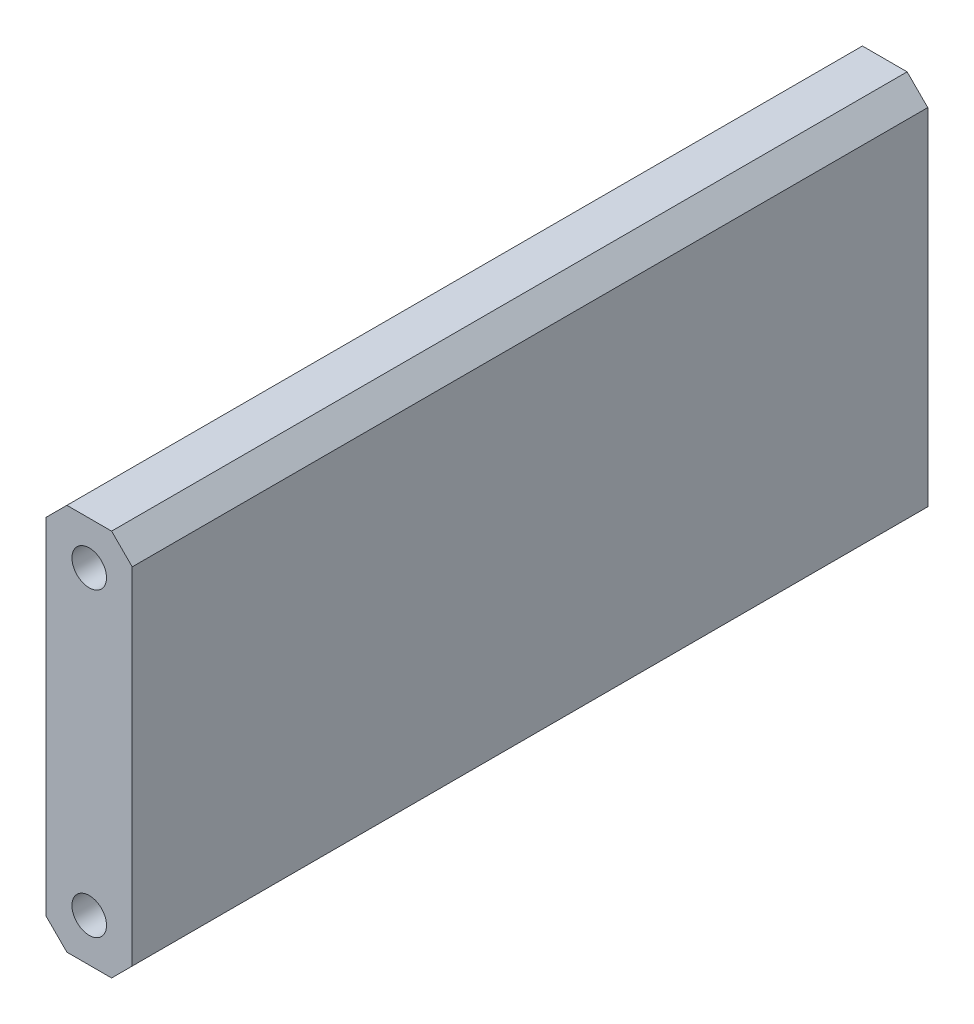
ISO-10303-21;
HEADER;
FILE_DESCRIPTION(('STEP AP214'),'2;1');
FILE_NAME('part.step','',(''),(''),'','','');
FILE_SCHEMA(('AUTOMOTIVE_DESIGN { 1 0 10303 214 1 1 1 1 }'));
ENDSEC;
DATA;
#1=APPLICATION_CONTEXT('core data for automotive mechanical design processes');
#2=APPLICATION_PROTOCOL_DEFINITION('international standard','automotive_design',2000,#1);
#3=PRODUCT_CONTEXT('',#1,'mechanical');
#4=PRODUCT('Part','Part','',(#3));
#5=PRODUCT_RELATED_PRODUCT_CATEGORY('part','',(#4));
#6=PRODUCT_DEFINITION_FORMATION('','',#4);
#7=PRODUCT_DEFINITION_CONTEXT('part definition',#1,'design');
#8=PRODUCT_DEFINITION('design','',#6,#7);
#9=PRODUCT_DEFINITION_SHAPE('','',#8);
#10=(LENGTH_UNIT() NAMED_UNIT(*) SI_UNIT(.MILLI.,.METRE.));
#11=(NAMED_UNIT(*) PLANE_ANGLE_UNIT() SI_UNIT($,.RADIAN.));
#12=(NAMED_UNIT(*) SI_UNIT($,.STERADIAN.) SOLID_ANGLE_UNIT());
#13=UNCERTAINTY_MEASURE_WITH_UNIT(LENGTH_MEASURE(1.E-05),#10,'distance_accuracy_value','');
#14=(GEOMETRIC_REPRESENTATION_CONTEXT(3) GLOBAL_UNCERTAINTY_ASSIGNED_CONTEXT((#13)) GLOBAL_UNIT_ASSIGNED_CONTEXT((#10,
#11,#12)) REPRESENTATION_CONTEXT('',''));
#15=CARTESIAN_POINT('',(0.,0.,0.));
#16=DIRECTION('',(0.,0.,1.));
#17=DIRECTION('',(1.,0.,0.));
#18=AXIS2_PLACEMENT_3D('',#15,#16,#17);
#19=CARTESIAN_POINT('',(-6.35,3.302,117.475));
#20=DIRECTION('',(1.,0.,0.));
#21=DIRECTION('',(0.,1.,0.));
#22=AXIS2_PLACEMENT_3D('',#19,#20,#21);
#23=PLANE('',#22);
#24=DIRECTION('',(0.,-1.,0.));
#25=VECTOR('',#24,1.);
#26=CARTESIAN_POINT('',(-6.35,3.302,0.));
#27=LINE('',#26,#25);
#28=CARTESIAN_POINT('',(-6.35,3.302,0.));
#29=VERTEX_POINT('',#28);
#30=CARTESIAN_POINT('',(-6.34999999999999,-47.752,0.));
#31=VERTEX_POINT('',#30);
#32=EDGE_CURVE('E133',#29,#31,#27,.T.);
#33=ORIENTED_EDGE('',*,*,#32,.T.);
#34=DIRECTION('',(0.,0.,-1.));
#35=VECTOR('',#34,1.);
#36=CARTESIAN_POINT('',(-6.34999999999999,-47.752,117.475));
#37=LINE('',#36,#35);
#38=CARTESIAN_POINT('',(-6.34999999999999,-47.752,117.475));
#39=VERTEX_POINT('',#38);
#40=EDGE_CURVE('E11',#39,#31,#37,.T.);
#41=ORIENTED_EDGE('',*,*,#40,.F.);
#42=DIRECTION('',(0.,-1.,0.));
#43=VECTOR('',#42,1.);
#44=CARTESIAN_POINT('',(-6.35,3.302,117.475));
#45=LINE('',#44,#43);
#46=CARTESIAN_POINT('',(-6.35,3.302,117.475));
#47=VERTEX_POINT('',#46);
#48=EDGE_CURVE('E148',#47,#39,#45,.T.);
#49=ORIENTED_EDGE('',*,*,#48,.F.);
#50=DIRECTION('',(0.,0.,-1.));
#51=VECTOR('',#50,1.);
#52=CARTESIAN_POINT('',(-6.35,3.302,117.475));
#53=LINE('',#52,#51);
#54=EDGE_CURVE('E129',#47,#29,#53,.T.);
#55=ORIENTED_EDGE('',*,*,#54,.T.);
#56=EDGE_LOOP('',(#33,#41,#49,#55));
#57=FACE_BOUND('',#56,.T.);
#58=ADVANCED_FACE('F34',(#57),#23,.F.);
#59=CARTESIAN_POINT('',(-3.30199999999999,-50.8,117.475));
#60=DIRECTION('',(0.707106781186548,0.707106781186547,0.));
#61=DIRECTION('',(-0.707106781186547,0.707106781186548,0.));
#62=AXIS2_PLACEMENT_3D('',#59,#60,#61);
#63=PLANE('',#62);
#64=DIRECTION('',(0.707106781186547,-0.707106781186548,0.));
#65=VECTOR('',#64,1.);
#66=CARTESIAN_POINT('',(-3.30199999999999,-50.8,0.));
#67=LINE('',#66,#65);
#68=CARTESIAN_POINT('',(-3.30199999999999,-50.8,0.));
#69=VERTEX_POINT('',#68);
#70=EDGE_CURVE('E136',#31,#69,#67,.T.);
#71=ORIENTED_EDGE('',*,*,#70,.T.);
#72=DIRECTION('',(0.,0.,-1.));
#73=VECTOR('',#72,1.);
#74=CARTESIAN_POINT('',(-3.30199999999999,-50.8,117.475));
#75=LINE('',#74,#73);
#76=CARTESIAN_POINT('',(-3.30199999999999,-50.8,117.475));
#77=VERTEX_POINT('',#76);
#78=EDGE_CURVE('E42',#77,#69,#75,.T.);
#79=ORIENTED_EDGE('',*,*,#78,.F.);
#80=DIRECTION('',(0.707106781186547,-0.707106781186548,0.));
#81=VECTOR('',#80,1.);
#82=CARTESIAN_POINT('',(-3.30199999999999,-50.8,117.475));
#83=LINE('',#82,#81);
#84=EDGE_CURVE('E94',#39,#77,#83,.T.);
#85=ORIENTED_EDGE('',*,*,#84,.F.);
#86=ORIENTED_EDGE('',*,*,#40,.T.);
#87=EDGE_LOOP('',(#71,#79,#85,#86));
#88=FACE_BOUND('',#87,.T.);
#89=ADVANCED_FACE('F230',(#88),#63,.F.);
#90=CARTESIAN_POINT('',(3.30200000000001,-50.8,117.475));
#91=DIRECTION('',(0.,1.,0.));
#92=DIRECTION('',(0.,0.,1.));
#93=AXIS2_PLACEMENT_3D('',#90,#91,#92);
#94=PLANE('',#93);
#95=DIRECTION('',(1.,0.,0.));
#96=VECTOR('',#95,1.);
#97=CARTESIAN_POINT('',(3.30200000000001,-50.8,0.));
#98=LINE('',#97,#96);
#99=CARTESIAN_POINT('',(3.30200000000001,-50.8,0.));
#100=VERTEX_POINT('',#99);
#101=EDGE_CURVE('E139',#69,#100,#98,.T.);
#102=ORIENTED_EDGE('',*,*,#101,.T.);
#103=DIRECTION('',(0.,0.,-1.));
#104=VECTOR('',#103,1.);
#105=CARTESIAN_POINT('',(3.30200000000001,-50.8,117.475));
#106=LINE('',#105,#104);
#107=CARTESIAN_POINT('',(3.30200000000001,-50.8,117.475));
#108=VERTEX_POINT('',#107);
#109=EDGE_CURVE('E155',#108,#100,#106,.T.);
#110=ORIENTED_EDGE('',*,*,#109,.F.);
#111=DIRECTION('',(1.,0.,0.));
#112=VECTOR('',#111,1.);
#113=CARTESIAN_POINT('',(3.30200000000001,-50.8,117.475));
#114=LINE('',#113,#112);
#115=EDGE_CURVE('E163',#77,#108,#114,.T.);
#116=ORIENTED_EDGE('',*,*,#115,.F.);
#117=ORIENTED_EDGE('',*,*,#78,.T.);
#118=EDGE_LOOP('',(#102,#110,#116,#117));
#119=FACE_BOUND('',#118,.T.);
#120=ADVANCED_FACE('F161',(#119),#94,.F.);
#121=CARTESIAN_POINT('',(6.35000000000001,-47.752,117.475));
#122=DIRECTION('',(-0.707106781186548,0.707106781186547,0.));
#123=DIRECTION('',(-0.707106781186547,-0.707106781186548,0.));
#124=AXIS2_PLACEMENT_3D('',#121,#122,#123);
#125=PLANE('',#124);
#126=DIRECTION('',(0.707106781186547,0.707106781186548,0.));
#127=VECTOR('',#126,1.);
#128=CARTESIAN_POINT('',(6.35000000000001,-47.752,0.));
#129=LINE('',#128,#127);
#130=CARTESIAN_POINT('',(6.35000000000001,-47.752,0.));
#131=VERTEX_POINT('',#130);
#132=EDGE_CURVE('E141',#100,#131,#129,.T.);
#133=ORIENTED_EDGE('',*,*,#132,.T.);
#134=DIRECTION('',(0.,0.,-1.));
#135=VECTOR('',#134,1.);
#136=CARTESIAN_POINT('',(6.35000000000001,-47.752,117.475));
#137=LINE('',#136,#135);
#138=CARTESIAN_POINT('',(6.35000000000001,-47.752,117.475));
#139=VERTEX_POINT('',#138);
#140=EDGE_CURVE('E152',#139,#131,#137,.T.);
#141=ORIENTED_EDGE('',*,*,#140,.F.);
#142=DIRECTION('',(0.707106781186547,0.707106781186548,0.));
#143=VECTOR('',#142,1.);
#144=CARTESIAN_POINT('',(6.35000000000001,-47.752,117.475));
#145=LINE('',#144,#143);
#146=EDGE_CURVE('E175',#108,#139,#145,.T.);
#147=ORIENTED_EDGE('',*,*,#146,.F.);
#148=ORIENTED_EDGE('',*,*,#109,.T.);
#149=EDGE_LOOP('',(#133,#141,#147,#148));
#150=FACE_BOUND('',#149,.T.);
#151=ADVANCED_FACE('F171',(#150),#125,.F.);
#152=CARTESIAN_POINT('',(6.35,3.302,117.475));
#153=DIRECTION('',(-1.,0.,0.));
#154=DIRECTION('',(0.,-1.,0.));
#155=AXIS2_PLACEMENT_3D('',#152,#153,#154);
#156=PLANE('',#155);
#157=DIRECTION('',(0.,1.,0.));
#158=VECTOR('',#157,1.);
#159=CARTESIAN_POINT('',(6.35,3.302,0.));
#160=LINE('',#159,#158);
#161=CARTESIAN_POINT('',(6.35,3.302,0.));
#162=VERTEX_POINT('',#161);
#163=EDGE_CURVE('E143',#131,#162,#160,.T.);
#164=ORIENTED_EDGE('',*,*,#163,.T.);
#165=DIRECTION('',(0.,0.,-1.));
#166=VECTOR('',#165,1.);
#167=CARTESIAN_POINT('',(6.35,3.302,117.475));
#168=LINE('',#167,#166);
#169=CARTESIAN_POINT('',(6.35,3.302,117.475));
#170=VERTEX_POINT('',#169);
#171=EDGE_CURVE('E124',#170,#162,#168,.T.);
#172=ORIENTED_EDGE('',*,*,#171,.F.);
#173=DIRECTION('',(0.,1.,0.));
#174=VECTOR('',#173,1.);
#175=CARTESIAN_POINT('',(6.35,3.302,117.475));
#176=LINE('',#175,#174);
#177=EDGE_CURVE('E115',#139,#170,#176,.T.);
#178=ORIENTED_EDGE('',*,*,#177,.F.);
#179=ORIENTED_EDGE('',*,*,#140,.T.);
#180=EDGE_LOOP('',(#164,#172,#178,#179));
#181=FACE_BOUND('',#180,.T.);
#182=ADVANCED_FACE('F174',(#181),#156,.F.);
#183=CARTESIAN_POINT('',(6.35,3.302,117.475));
#184=DIRECTION('',(-0.707106781186547,-0.707106781186548,0.));
#185=DIRECTION('',(0.707106781186548,-0.707106781186547,0.));
#186=AXIS2_PLACEMENT_3D('',#183,#184,#185);
#187=PLANE('',#186);
#188=DIRECTION('',(-0.707106781186548,0.707106781186547,0.));
#189=VECTOR('',#188,1.);
#190=CARTESIAN_POINT('',(6.35,3.302,0.));
#191=LINE('',#190,#189);
#192=CARTESIAN_POINT('',(3.302,6.35,0.));
#193=VERTEX_POINT('',#192);
#194=EDGE_CURVE('E123',#162,#193,#191,.T.);
#195=ORIENTED_EDGE('',*,*,#194,.T.);
#196=DIRECTION('',(0.,0.,-1.));
#197=VECTOR('',#196,1.);
#198=CARTESIAN_POINT('',(3.302,6.35,117.475));
#199=LINE('',#198,#197);
#200=CARTESIAN_POINT('',(3.302,6.35,117.475));
#201=VERTEX_POINT('',#200);
#202=EDGE_CURVE('E120',#201,#193,#199,.T.);
#203=ORIENTED_EDGE('',*,*,#202,.F.);
#204=DIRECTION('',(-0.707106781186548,0.707106781186547,0.));
#205=VECTOR('',#204,1.);
#206=CARTESIAN_POINT('',(6.35,3.302,117.475));
#207=LINE('',#206,#205);
#208=EDGE_CURVE('E109',#170,#201,#207,.T.);
#209=ORIENTED_EDGE('',*,*,#208,.F.);
#210=ORIENTED_EDGE('',*,*,#171,.T.);
#211=EDGE_LOOP('',(#195,#203,#209,#210));
#212=FACE_BOUND('',#211,.T.);
#213=ADVANCED_FACE('F121',(#212),#187,.F.);
#214=CARTESIAN_POINT('',(3.302,6.35,117.475));
#215=DIRECTION('',(0.,-1.,0.));
#216=DIRECTION('',(1.,0.,0.));
#217=AXIS2_PLACEMENT_3D('',#214,#215,#216);
#218=PLANE('',#217);
#219=DIRECTION('',(-1.,0.,0.));
#220=VECTOR('',#219,1.);
#221=CARTESIAN_POINT('',(3.302,6.35,0.));
#222=LINE('',#221,#220);
#223=CARTESIAN_POINT('',(-3.302,6.35,0.));
#224=VERTEX_POINT('',#223);
#225=EDGE_CURVE('E80',#193,#224,#222,.T.);
#226=ORIENTED_EDGE('',*,*,#225,.T.);
#227=DIRECTION('',(0.,0.,-1.));
#228=VECTOR('',#227,1.);
#229=CARTESIAN_POINT('',(-3.302,6.35,117.475));
#230=LINE('',#229,#228);
#231=CARTESIAN_POINT('',(-3.302,6.35,117.475));
#232=VERTEX_POINT('',#231);
#233=EDGE_CURVE('E125',#232,#224,#230,.T.);
#234=ORIENTED_EDGE('',*,*,#233,.F.);
#235=DIRECTION('',(-1.,0.,0.));
#236=VECTOR('',#235,1.);
#237=CARTESIAN_POINT('',(3.302,6.35,117.475));
#238=LINE('',#237,#236);
#239=EDGE_CURVE('E113',#201,#232,#238,.T.);
#240=ORIENTED_EDGE('',*,*,#239,.F.);
#241=ORIENTED_EDGE('',*,*,#202,.T.);
#242=EDGE_LOOP('',(#226,#234,#240,#241));
#243=FACE_BOUND('',#242,.T.);
#244=ADVANCED_FACE('F127',(#243),#218,.F.);
#245=CARTESIAN_POINT('',(-3.302,6.35,117.475));
#246=DIRECTION('',(0.707106781186548,-0.707106781186547,0.));
#247=DIRECTION('',(0.707106781186547,0.707106781186548,0.));
#248=AXIS2_PLACEMENT_3D('',#245,#246,#247);
#249=PLANE('',#248);
#250=DIRECTION('',(-0.707106781186547,-0.707106781186547,0.));
#251=VECTOR('',#250,1.);
#252=CARTESIAN_POINT('',(-3.302,6.35,0.));
#253=LINE('',#252,#251);
#254=EDGE_CURVE('E86',#224,#29,#253,.T.);
#255=ORIENTED_EDGE('',*,*,#254,.T.);
#256=ORIENTED_EDGE('',*,*,#54,.F.);
#257=DIRECTION('',(-0.707106781186547,-0.707106781186547,0.));
#258=VECTOR('',#257,1.);
#259=CARTESIAN_POINT('',(-3.302,6.35,117.475));
#260=LINE('',#259,#258);
#261=EDGE_CURVE('E50',#232,#47,#260,.T.);
#262=ORIENTED_EDGE('',*,*,#261,.F.);
#263=ORIENTED_EDGE('',*,*,#233,.T.);
#264=EDGE_LOOP('',(#255,#256,#262,#263));
#265=FACE_BOUND('',#264,.T.);
#266=ADVANCED_FACE('F237',(#265),#249,.F.);
#267=CARTESIAN_POINT('',(-6.34999999999999,-50.8,117.475));
#268=DIRECTION('',(0.,0.,-1.));
#269=DIRECTION('',(-1.,0.,0.));
#270=AXIS2_PLACEMENT_3D('',#267,#268,#269);
#271=PLANE('',#270);
#272=CARTESIAN_POINT('',(0.,0.,117.475));
#273=DIRECTION('',(0.,0.,1.));
#274=DIRECTION('',(1.,0.,0.));
#275=AXIS2_PLACEMENT_3D('',#272,#273,#274);
#276=CIRCLE('',#275,2.5527);
#277=CARTESIAN_POINT('',(2.5527,0.,117.475));
#278=VERTEX_POINT('',#277);
#279=EDGE_CURVE('E189',#278,#278,#276,.T.);
#280=ORIENTED_EDGE('',*,*,#279,.F.);
#281=EDGE_LOOP('',(#280));
#282=FACE_BOUND('',#281,.T.);
#283=CARTESIAN_POINT('',(0.,-44.45,117.475));
#284=DIRECTION('',(0.,0.,1.));
#285=DIRECTION('',(1.,0.,0.));
#286=AXIS2_PLACEMENT_3D('',#283,#284,#285);
#287=CIRCLE('',#286,2.5527);
#288=CARTESIAN_POINT('',(2.5527,-44.45,117.475));
#289=VERTEX_POINT('',#288);
#290=EDGE_CURVE('E183',#289,#289,#287,.T.);
#291=ORIENTED_EDGE('',*,*,#290,.F.);
#292=EDGE_LOOP('',(#291));
#293=FACE_BOUND('',#292,.T.);
#294=ORIENTED_EDGE('',*,*,#48,.T.);
#295=ORIENTED_EDGE('',*,*,#84,.T.);
#296=ORIENTED_EDGE('',*,*,#115,.T.);
#297=ORIENTED_EDGE('',*,*,#146,.T.);
#298=ORIENTED_EDGE('',*,*,#177,.T.);
#299=ORIENTED_EDGE('',*,*,#208,.T.);
#300=ORIENTED_EDGE('',*,*,#239,.T.);
#301=ORIENTED_EDGE('',*,*,#261,.T.);
#302=EDGE_LOOP('',(#294,#295,#296,#297,#298,#299,#300,#301));
#303=FACE_BOUND('',#302,.T.);
#304=ADVANCED_FACE('F111',(#282,#293,#303),#271,.F.);
#305=CARTESIAN_POINT('',(-6.34999999999999,-50.8,0.));
#306=DIRECTION('',(0.,0.,-1.));
#307=DIRECTION('',(-1.,0.,0.));
#308=AXIS2_PLACEMENT_3D('',#305,#306,#307);
#309=PLANE('',#308);
#310=CARTESIAN_POINT('',(0.,0.,0.));
#311=DIRECTION('',(0.,0.,-1.));
#312=DIRECTION('',(-1.,0.,0.));
#313=AXIS2_PLACEMENT_3D('',#310,#311,#312);
#314=CIRCLE('',#313,2.5527);
#315=CARTESIAN_POINT('',(-2.5527,0.,0.));
#316=VERTEX_POINT('',#315);
#317=EDGE_CURVE('E201',#316,#316,#314,.T.);
#318=ORIENTED_EDGE('',*,*,#317,.F.);
#319=EDGE_LOOP('',(#318));
#320=FACE_BOUND('',#319,.T.);
#321=CARTESIAN_POINT('',(0.,-44.2438674121102,0.));
#322=DIRECTION('',(0.,0.,-1.));
#323=DIRECTION('',(-1.,0.,0.));
#324=AXIS2_PLACEMENT_3D('',#321,#322,#323);
#325=CIRCLE('',#324,2.5527);
#326=CARTESIAN_POINT('',(-2.5527,-44.2438674121102,0.));
#327=VERTEX_POINT('',#326);
#328=EDGE_CURVE('E195',#327,#327,#325,.T.);
#329=ORIENTED_EDGE('',*,*,#328,.F.);
#330=EDGE_LOOP('',(#329));
#331=FACE_BOUND('',#330,.T.);
#332=ORIENTED_EDGE('',*,*,#32,.F.);
#333=ORIENTED_EDGE('',*,*,#254,.F.);
#334=ORIENTED_EDGE('',*,*,#225,.F.);
#335=ORIENTED_EDGE('',*,*,#194,.F.);
#336=ORIENTED_EDGE('',*,*,#163,.F.);
#337=ORIENTED_EDGE('',*,*,#132,.F.);
#338=ORIENTED_EDGE('',*,*,#101,.F.);
#339=ORIENTED_EDGE('',*,*,#70,.F.);
#340=EDGE_LOOP('',(#332,#333,#334,#335,#336,#337,#338,#339));
#341=FACE_BOUND('',#340,.T.);
#342=ADVANCED_FACE('F167',(#320,#331,#341),#309,.T.);
#343=CARTESIAN_POINT('',(0.,-44.45,94.615));
#344=DIRECTION('',(0.,0.,1.));
#345=DIRECTION('',(1.,0.,0.));
#346=AXIS2_PLACEMENT_3D('',#343,#344,#345);
#347=CONICAL_SURFACE('',#346,2.55269999999999,1.02974425867665);
#348=CARTESIAN_POINT('',(0.,-44.45,93.0811830978083));
#349=VERTEX_POINT('',#348);
#350=VERTEX_LOOP('',#349);
#351=FACE_BOUND('',#350,.T.);
#352=CARTESIAN_POINT('',(0.,-44.45,94.615));
#353=DIRECTION('',(0.,0.,1.));
#354=DIRECTION('',(1.,0.,0.));
#355=AXIS2_PLACEMENT_3D('',#352,#353,#354);
#356=CIRCLE('',#355,2.55269999999999);
#357=CARTESIAN_POINT('',(2.5527,-44.45,94.615));
#358=VERTEX_POINT('',#357);
#359=EDGE_CURVE('E137',#358,#358,#356,.T.);
#360=ORIENTED_EDGE('',*,*,#359,.T.);
#361=EDGE_LOOP('',(#360));
#362=FACE_BOUND('',#361,.T.);
#363=ADVANCED_FACE('F209',(#351,#362),#347,.F.);
#364=CARTESIAN_POINT('',(0.,-44.45,117.475));
#365=DIRECTION('',(0.,0.,1.));
#366=DIRECTION('',(1.,0.,0.));
#367=AXIS2_PLACEMENT_3D('',#364,#365,#366);
#368=CYLINDRICAL_SURFACE('',#367,2.5527);
#369=ORIENTED_EDGE('',*,*,#359,.F.);
#370=EDGE_LOOP('',(#369));
#371=FACE_BOUND('',#370,.T.);
#372=ORIENTED_EDGE('',*,*,#290,.T.);
#373=EDGE_LOOP('',(#372));
#374=FACE_BOUND('',#373,.T.);
#375=ADVANCED_FACE('F295',(#371,#374),#368,.F.);
#376=CARTESIAN_POINT('',(0.,0.,94.615));
#377=DIRECTION('',(0.,0.,1.));
#378=DIRECTION('',(1.,0.,0.));
#379=AXIS2_PLACEMENT_3D('',#376,#377,#378);
#380=CONICAL_SURFACE('',#379,2.55269999999999,1.02974425867665);
#381=CARTESIAN_POINT('',(0.,0.,93.0811830978083));
#382=VERTEX_POINT('',#381);
#383=VERTEX_LOOP('',#382);
#384=FACE_BOUND('',#383,.T.);
#385=CARTESIAN_POINT('',(0.,0.,94.615));
#386=DIRECTION('',(0.,0.,1.));
#387=DIRECTION('',(1.,0.,0.));
#388=AXIS2_PLACEMENT_3D('',#385,#386,#387);
#389=CIRCLE('',#388,2.55269999999999);
#390=CARTESIAN_POINT('',(2.55269999999999,0.,94.615));
#391=VERTEX_POINT('',#390);
#392=EDGE_CURVE('E186',#391,#391,#389,.T.);
#393=ORIENTED_EDGE('',*,*,#392,.T.);
#394=EDGE_LOOP('',(#393));
#395=FACE_BOUND('',#394,.T.);
#396=ADVANCED_FACE('F306',(#384,#395),#380,.F.);
#397=CARTESIAN_POINT('',(0.,0.,117.475));
#398=DIRECTION('',(0.,0.,1.));
#399=DIRECTION('',(1.,0.,0.));
#400=AXIS2_PLACEMENT_3D('',#397,#398,#399);
#401=CYLINDRICAL_SURFACE('',#400,2.5527);
#402=ORIENTED_EDGE('',*,*,#392,.F.);
#403=EDGE_LOOP('',(#402));
#404=FACE_BOUND('',#403,.T.);
#405=ORIENTED_EDGE('',*,*,#279,.T.);
#406=EDGE_LOOP('',(#405));
#407=FACE_BOUND('',#406,.T.);
#408=ADVANCED_FACE('F225',(#404,#407),#401,.F.);
#409=CARTESIAN_POINT('',(0.,-44.2438674121102,23.9014));
#410=DIRECTION('',(0.,0.,-1.));
#411=DIRECTION('',(-1.,0.,0.));
#412=AXIS2_PLACEMENT_3D('',#409,#410,#411);
#413=CONICAL_SURFACE('',#412,2.55269999999999,1.02974425867665);
#414=CARTESIAN_POINT('',(0.,-44.2438674121102,25.4352169021917));
#415=VERTEX_POINT('',#414);
#416=VERTEX_LOOP('',#415);
#417=FACE_BOUND('',#416,.T.);
#418=CARTESIAN_POINT('',(0.,-44.2438674121102,23.9014));
#419=DIRECTION('',(0.,0.,-1.));
#420=DIRECTION('',(-1.,0.,0.));
#421=AXIS2_PLACEMENT_3D('',#418,#419,#420);
#422=CIRCLE('',#421,2.55269999999999);
#423=CARTESIAN_POINT('',(-2.55269999999999,-44.2438674121102,23.9014));
#424=VERTEX_POINT('',#423);
#425=EDGE_CURVE('E192',#424,#424,#422,.T.);
#426=ORIENTED_EDGE('',*,*,#425,.T.);
#427=EDGE_LOOP('',(#426));
#428=FACE_BOUND('',#427,.T.);
#429=ADVANCED_FACE('F216',(#417,#428),#413,.F.);
#430=CARTESIAN_POINT('',(0.,-44.2438674121102,0.));
#431=DIRECTION('',(0.,0.,-1.));
#432=DIRECTION('',(-1.,0.,0.));
#433=AXIS2_PLACEMENT_3D('',#430,#431,#432);
#434=CYLINDRICAL_SURFACE('',#433,2.5527);
#435=ORIENTED_EDGE('',*,*,#425,.F.);
#436=EDGE_LOOP('',(#435));
#437=FACE_BOUND('',#436,.T.);
#438=ORIENTED_EDGE('',*,*,#328,.T.);
#439=EDGE_LOOP('',(#438));
#440=FACE_BOUND('',#439,.T.);
#441=ADVANCED_FACE('F213',(#437,#440),#434,.F.);
#442=CARTESIAN_POINT('',(0.,0.,23.9014));
#443=DIRECTION('',(0.,0.,-1.));
#444=DIRECTION('',(-1.,0.,0.));
#445=AXIS2_PLACEMENT_3D('',#442,#443,#444);
#446=CONICAL_SURFACE('',#445,2.55269999999999,1.02974425867665);
#447=CARTESIAN_POINT('',(0.,0.,25.4352169021917));
#448=VERTEX_POINT('',#447);
#449=VERTEX_LOOP('',#448);
#450=FACE_BOUND('',#449,.T.);
#451=CARTESIAN_POINT('',(0.,0.,23.9014));
#452=DIRECTION('',(0.,0.,-1.));
#453=DIRECTION('',(-1.,0.,0.));
#454=AXIS2_PLACEMENT_3D('',#451,#452,#453);
#455=CIRCLE('',#454,2.55269999999999);
#456=CARTESIAN_POINT('',(-2.55269999999999,0.,23.9014));
#457=VERTEX_POINT('',#456);
#458=EDGE_CURVE('E198',#457,#457,#455,.T.);
#459=ORIENTED_EDGE('',*,*,#458,.T.);
#460=EDGE_LOOP('',(#459));
#461=FACE_BOUND('',#460,.T.);
#462=ADVANCED_FACE('F215',(#450,#461),#446,.F.);
#463=CARTESIAN_POINT('',(0.,0.,0.));
#464=DIRECTION('',(0.,0.,-1.));
#465=DIRECTION('',(-1.,0.,0.));
#466=AXIS2_PLACEMENT_3D('',#463,#464,#465);
#467=CYLINDRICAL_SURFACE('',#466,2.5527);
#468=ORIENTED_EDGE('',*,*,#458,.F.);
#469=EDGE_LOOP('',(#468));
#470=FACE_BOUND('',#469,.T.);
#471=ORIENTED_EDGE('',*,*,#317,.T.);
#472=EDGE_LOOP('',(#471));
#473=FACE_BOUND('',#472,.T.);
#474=ADVANCED_FACE('F205',(#470,#473),#467,.F.);
#475=CLOSED_SHELL('',(#58,#89,#120,#151,#182,#213,#244,#266,#304,#342,#363,#375,#396,#408,#429,
#441,#462,#474));
#476=MANIFOLD_SOLID_BREP('B2',#475);
#477=ADVANCED_BREP_SHAPE_REPRESENTATION('',(#18,#476),#14);
#478=SHAPE_DEFINITION_REPRESENTATION(#9,#477);
ENDSEC;
END-ISO-10303-21;
